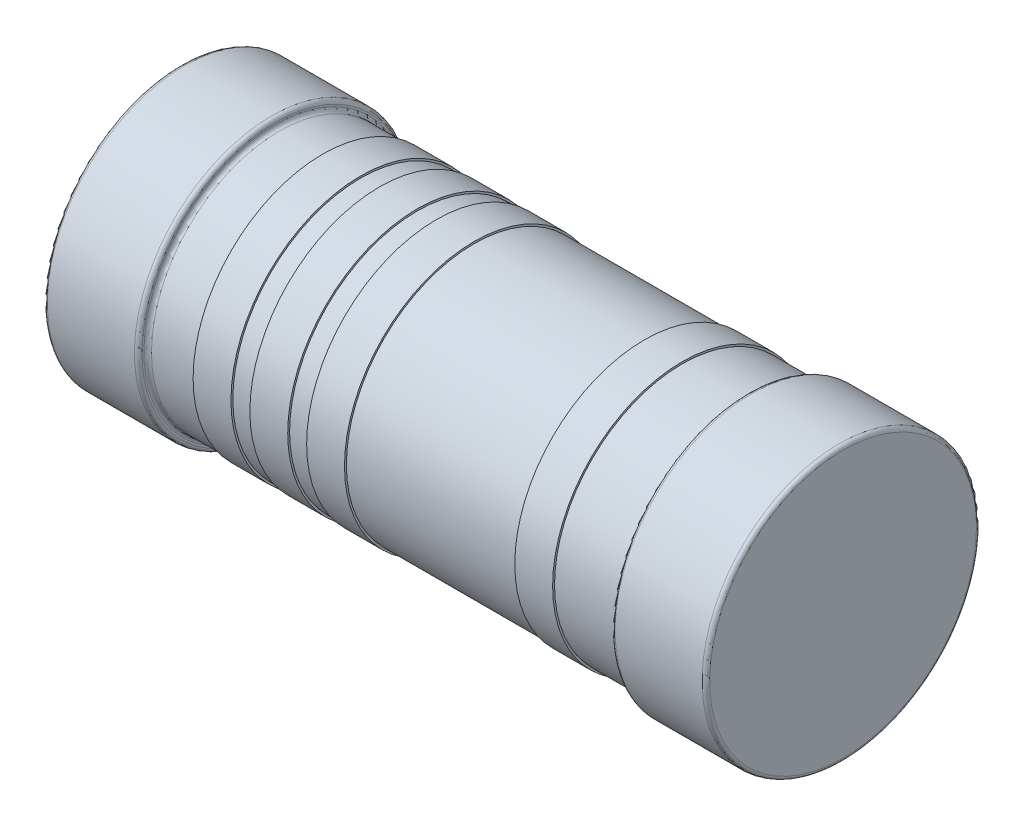
ISO-10303-21;
HEADER;
FILE_DESCRIPTION(('STEP AP214'),'2;1');
FILE_NAME('part.step','',(''),(''),'','','');
FILE_SCHEMA(('AUTOMOTIVE_DESIGN { 1 0 10303 214 1 1 1 1 }'));
ENDSEC;
DATA;
#1=APPLICATION_CONTEXT('core data for automotive mechanical design processes');
#2=APPLICATION_PROTOCOL_DEFINITION('international standard','automotive_design',2000,#1);
#3=PRODUCT_CONTEXT('',#1,'mechanical');
#4=PRODUCT('Part','Part','',(#3));
#5=PRODUCT_RELATED_PRODUCT_CATEGORY('part','',(#4));
#6=PRODUCT_DEFINITION_FORMATION('','',#4);
#7=PRODUCT_DEFINITION_CONTEXT('part definition',#1,'design');
#8=PRODUCT_DEFINITION('design','',#6,#7);
#9=PRODUCT_DEFINITION_SHAPE('','',#8);
#10=(LENGTH_UNIT() NAMED_UNIT(*) SI_UNIT(.MILLI.,.METRE.));
#11=(NAMED_UNIT(*) PLANE_ANGLE_UNIT() SI_UNIT($,.RADIAN.));
#12=(NAMED_UNIT(*) SI_UNIT($,.STERADIAN.) SOLID_ANGLE_UNIT());
#13=UNCERTAINTY_MEASURE_WITH_UNIT(LENGTH_MEASURE(1.E-05),#10,'distance_accuracy_value','');
#14=(GEOMETRIC_REPRESENTATION_CONTEXT(3) GLOBAL_UNCERTAINTY_ASSIGNED_CONTEXT((#13)) GLOBAL_UNIT_ASSIGNED_CONTEXT((#10,
#11,#12)) REPRESENTATION_CONTEXT('',''));
#15=CARTESIAN_POINT('',(0.,0.,0.));
#16=DIRECTION('',(0.,0.,1.));
#17=DIRECTION('',(1.,0.,0.));
#18=AXIS2_PLACEMENT_3D('',#15,#16,#17);
#19=CARTESIAN_POINT('',(-1.75,0.0200000000000001,0.));
#20=DIRECTION('',(1.,0.,0.));
#21=DIRECTION('',(0.,1.,0.));
#22=AXIS2_PLACEMENT_3D('',#19,#20,#21);
#23=PLANE('',#22);
#24=CARTESIAN_POINT('',(-1.75,0.725,0.));
#25=DIRECTION('',(1.,0.,0.));
#26=DIRECTION('',(0.,1.,0.));
#27=AXIS2_PLACEMENT_3D('',#24,#25,#26);
#28=CIRCLE('',#27,0.705);
#29=CARTESIAN_POINT('',(-1.75,1.43,0.));
#30=VERTEX_POINT('',#29);
#31=EDGE_CURVE('E121',#30,#30,#28,.T.);
#32=ORIENTED_EDGE('',*,*,#31,.F.);
#33=EDGE_LOOP('',(#32));
#34=FACE_BOUND('',#33,.T.);
#35=ADVANCED_FACE('F33',(#34),#23,.F.);
#36=CARTESIAN_POINT('',(1.75,0.725,0.));
#37=DIRECTION('',(-1.,0.,0.));
#38=DIRECTION('',(0.,-1.,0.));
#39=AXIS2_PLACEMENT_3D('',#36,#37,#38);
#40=PLANE('',#39);
#41=CARTESIAN_POINT('',(1.75,0.725,0.));
#42=DIRECTION('',(1.,0.,0.));
#43=DIRECTION('',(0.,1.,0.));
#44=AXIS2_PLACEMENT_3D('',#41,#42,#43);
#45=CIRCLE('',#44,0.705);
#46=CARTESIAN_POINT('',(1.75,1.43,0.));
#47=VERTEX_POINT('',#46);
#48=EDGE_CURVE('E10',#47,#47,#45,.T.);
#49=ORIENTED_EDGE('',*,*,#48,.T.);
#50=EDGE_LOOP('',(#49));
#51=FACE_BOUND('',#50,.T.);
#52=ADVANCED_FACE('F128',(#51),#40,.F.);
#53=CARTESIAN_POINT('',(1.73,0.725,0.));
#54=DIRECTION('',(1.,0.,0.));
#55=DIRECTION('',(0.,1.,0.));
#56=AXIS2_PLACEMENT_3D('',#53,#54,#55);
#57=TOROIDAL_SURFACE('',#56,0.705,0.0199999999999999);
#58=ORIENTED_EDGE('',*,*,#48,.F.);
#59=EDGE_LOOP('',(#58));
#60=FACE_BOUND('',#59,.T.);
#61=CARTESIAN_POINT('',(1.73,0.725,0.));
#62=DIRECTION('',(1.,0.,0.));
#63=DIRECTION('',(0.,1.,0.));
#64=AXIS2_PLACEMENT_3D('',#61,#62,#63);
#65=CIRCLE('',#64,0.725);
#66=CARTESIAN_POINT('',(1.73,1.45,0.));
#67=VERTEX_POINT('',#66);
#68=EDGE_CURVE('E39',#67,#67,#65,.T.);
#69=ORIENTED_EDGE('',*,*,#68,.T.);
#70=EDGE_LOOP('',(#69));
#71=FACE_BOUND('',#70,.T.);
#72=ADVANCED_FACE('F132',(#60,#71),#57,.T.);
#73=CARTESIAN_POINT('',(-1.75,0.725,0.));
#74=DIRECTION('',(1.,0.,0.));
#75=DIRECTION('',(0.,1.,0.));
#76=AXIS2_PLACEMENT_3D('',#73,#74,#75);
#77=CYLINDRICAL_SURFACE('',#76,0.725);
#78=ORIENTED_EDGE('',*,*,#68,.F.);
#79=EDGE_LOOP('',(#78));
#80=FACE_BOUND('',#79,.T.);
#81=CARTESIAN_POINT('',(1.27,0.725,0.));
#82=DIRECTION('',(1.,0.,0.));
#83=DIRECTION('',(0.,1.,0.));
#84=AXIS2_PLACEMENT_3D('',#81,#82,#83);
#85=CIRCLE('',#84,0.725);
#86=CARTESIAN_POINT('',(1.27,1.45,0.));
#87=VERTEX_POINT('',#86);
#88=EDGE_CURVE('E43',#87,#87,#85,.T.);
#89=ORIENTED_EDGE('',*,*,#88,.T.);
#90=EDGE_LOOP('',(#89));
#91=FACE_BOUND('',#90,.T.);
#92=ADVANCED_FACE('F136',(#80,#91),#77,.T.);
#93=CARTESIAN_POINT('',(1.27,0.725,0.));
#94=DIRECTION('',(1.,0.,0.));
#95=DIRECTION('',(0.,1.,0.));
#96=AXIS2_PLACEMENT_3D('',#93,#94,#95);
#97=TOROIDAL_SURFACE('',#96,0.705,0.0200000000000001);
#98=ORIENTED_EDGE('',*,*,#88,.F.);
#99=EDGE_LOOP('',(#98));
#100=FACE_BOUND('',#99,.T.);
#101=CARTESIAN_POINT('',(1.25,0.725,0.));
#102=DIRECTION('',(1.,0.,0.));
#103=DIRECTION('',(0.,1.,0.));
#104=AXIS2_PLACEMENT_3D('',#101,#102,#103);
#105=CIRCLE('',#104,0.705);
#106=CARTESIAN_POINT('',(1.25,1.43,0.));
#107=VERTEX_POINT('',#106);
#108=EDGE_CURVE('E47',#107,#107,#105,.T.);
#109=ORIENTED_EDGE('',*,*,#108,.T.);
#110=EDGE_LOOP('',(#109));
#111=FACE_BOUND('',#110,.T.);
#112=ADVANCED_FACE('F142',(#100,#111),#97,.T.);
#113=CARTESIAN_POINT('',(1.25,0.03,0.));
#114=DIRECTION('',(1.,0.,0.));
#115=DIRECTION('',(0.,1.,0.));
#116=AXIS2_PLACEMENT_3D('',#113,#114,#115);
#117=PLANE('',#116);
#118=ORIENTED_EDGE('',*,*,#108,.F.);
#119=EDGE_LOOP('',(#118));
#120=FACE_BOUND('',#119,.T.);
#121=CARTESIAN_POINT('',(1.25,0.725,0.));
#122=DIRECTION('',(1.,0.,0.));
#123=DIRECTION('',(0.,1.,0.));
#124=AXIS2_PLACEMENT_3D('',#121,#122,#123);
#125=CIRCLE('',#124,0.695);
#126=CARTESIAN_POINT('',(1.25,1.42,0.));
#127=VERTEX_POINT('',#126);
#128=EDGE_CURVE('E52',#127,#127,#125,.T.);
#129=ORIENTED_EDGE('',*,*,#128,.T.);
#130=EDGE_LOOP('',(#129));
#131=FACE_BOUND('',#130,.T.);
#132=ADVANCED_FACE('F146',(#120,#131),#117,.F.);
#133=CARTESIAN_POINT('',(1.23,0.725,0.));
#134=DIRECTION('',(1.,0.,0.));
#135=DIRECTION('',(0.,1.,0.));
#136=AXIS2_PLACEMENT_3D('',#133,#134,#135);
#137=TOROIDAL_SURFACE('',#136,0.695,0.0199999999999999);
#138=ORIENTED_EDGE('',*,*,#128,.F.);
#139=EDGE_LOOP('',(#138));
#140=FACE_BOUND('',#139,.T.);
#141=CARTESIAN_POINT('',(1.23,0.725,0.));
#142=DIRECTION('',(1.,0.,0.));
#143=DIRECTION('',(0.,1.,0.));
#144=AXIS2_PLACEMENT_3D('',#141,#142,#143);
#145=CIRCLE('',#144,0.675);
#146=CARTESIAN_POINT('',(1.23,1.4,0.));
#147=VERTEX_POINT('',#146);
#148=EDGE_CURVE('E55',#147,#147,#145,.T.);
#149=ORIENTED_EDGE('',*,*,#148,.T.);
#150=EDGE_LOOP('',(#149));
#151=FACE_BOUND('',#150,.T.);
#152=ADVANCED_FACE('F150',(#140,#151),#137,.F.);
#153=CARTESIAN_POINT('',(-1.75,0.725,0.));
#154=DIRECTION('',(1.,0.,0.));
#155=DIRECTION('',(0.,1.,0.));
#156=AXIS2_PLACEMENT_3D('',#153,#154,#155);
#157=CYLINDRICAL_SURFACE('',#156,0.675);
#158=ORIENTED_EDGE('',*,*,#148,.F.);
#159=EDGE_LOOP('',(#158));
#160=FACE_BOUND('',#159,.T.);
#161=CARTESIAN_POINT('',(0.9,0.725,0.));
#162=DIRECTION('',(1.,0.,0.));
#163=DIRECTION('',(0.,1.,0.));
#164=AXIS2_PLACEMENT_3D('',#161,#162,#163);
#165=CIRCLE('',#164,0.675);
#166=CARTESIAN_POINT('',(0.9,1.4,0.));
#167=VERTEX_POINT('',#166);
#168=EDGE_CURVE('E58',#167,#167,#165,.T.);
#169=ORIENTED_EDGE('',*,*,#168,.T.);
#170=EDGE_LOOP('',(#169));
#171=FACE_BOUND('',#170,.T.);
#172=ADVANCED_FACE('F154',(#160,#171),#157,.T.);
#173=CARTESIAN_POINT('',(0.9,0.05,0.));
#174=DIRECTION('',(-1.,0.,0.));
#175=DIRECTION('',(0.,-1.,0.));
#176=AXIS2_PLACEMENT_3D('',#173,#174,#175);
#177=PLANE('',#176);
#178=ORIENTED_EDGE('',*,*,#168,.F.);
#179=EDGE_LOOP('',(#178));
#180=FACE_BOUND('',#179,.T.);
#181=CARTESIAN_POINT('',(0.9,0.725,0.));
#182=DIRECTION('',(1.,0.,0.));
#183=DIRECTION('',(0.,1.,0.));
#184=AXIS2_PLACEMENT_3D('',#181,#182,#183);
#185=CIRCLE('',#184,0.685);
#186=CARTESIAN_POINT('',(0.9,1.41,0.));
#187=VERTEX_POINT('',#186);
#188=EDGE_CURVE('E61',#187,#187,#185,.T.);
#189=ORIENTED_EDGE('',*,*,#188,.T.);
#190=EDGE_LOOP('',(#189));
#191=FACE_BOUND('',#190,.T.);
#192=ADVANCED_FACE('F158',(#180,#191),#177,.F.);
#193=CARTESIAN_POINT('',(-1.75,0.725,0.));
#194=DIRECTION('',(1.,0.,0.));
#195=DIRECTION('',(0.,1.,0.));
#196=AXIS2_PLACEMENT_3D('',#193,#194,#195);
#197=CYLINDRICAL_SURFACE('',#196,0.685);
#198=ORIENTED_EDGE('',*,*,#188,.F.);
#199=EDGE_LOOP('',(#198));
#200=FACE_BOUND('',#199,.T.);
#201=CARTESIAN_POINT('',(0.7,0.725,0.));
#202=DIRECTION('',(1.,0.,0.));
#203=DIRECTION('',(0.,1.,0.));
#204=AXIS2_PLACEMENT_3D('',#201,#202,#203);
#205=CIRCLE('',#204,0.685);
#206=CARTESIAN_POINT('',(0.7,1.41,0.));
#207=VERTEX_POINT('',#206);
#208=EDGE_CURVE('E64',#207,#207,#205,.T.);
#209=ORIENTED_EDGE('',*,*,#208,.T.);
#210=EDGE_LOOP('',(#209));
#211=FACE_BOUND('',#210,.T.);
#212=ADVANCED_FACE('F162',(#200,#211),#197,.T.);
#213=CARTESIAN_POINT('',(0.7,0.0400000000000001,0.));
#214=DIRECTION('',(1.,0.,0.));
#215=DIRECTION('',(0.,1.,0.));
#216=AXIS2_PLACEMENT_3D('',#213,#214,#215);
#217=PLANE('',#216);
#218=ORIENTED_EDGE('',*,*,#208,.F.);
#219=EDGE_LOOP('',(#218));
#220=FACE_BOUND('',#219,.T.);
#221=CARTESIAN_POINT('',(0.7,0.725,0.));
#222=DIRECTION('',(1.,0.,0.));
#223=DIRECTION('',(0.,1.,0.));
#224=AXIS2_PLACEMENT_3D('',#221,#222,#223);
#225=CIRCLE('',#224,0.675);
#226=CARTESIAN_POINT('',(0.7,1.4,0.));
#227=VERTEX_POINT('',#226);
#228=EDGE_CURVE('E67',#227,#227,#225,.T.);
#229=ORIENTED_EDGE('',*,*,#228,.T.);
#230=EDGE_LOOP('',(#229));
#231=FACE_BOUND('',#230,.T.);
#232=ADVANCED_FACE('F166',(#220,#231),#217,.F.);
#233=CARTESIAN_POINT('',(-1.75,0.725,0.));
#234=DIRECTION('',(1.,0.,0.));
#235=DIRECTION('',(0.,1.,0.));
#236=AXIS2_PLACEMENT_3D('',#233,#234,#235);
#237=CYLINDRICAL_SURFACE('',#236,0.675);
#238=ORIENTED_EDGE('',*,*,#228,.F.);
#239=EDGE_LOOP('',(#238));
#240=FACE_BOUND('',#239,.T.);
#241=CARTESIAN_POINT('',(-0.2,0.725,0.));
#242=DIRECTION('',(1.,0.,0.));
#243=DIRECTION('',(0.,1.,0.));
#244=AXIS2_PLACEMENT_3D('',#241,#242,#243);
#245=CIRCLE('',#244,0.675);
#246=CARTESIAN_POINT('',(-0.2,1.4,0.));
#247=VERTEX_POINT('',#246);
#248=EDGE_CURVE('E70',#247,#247,#245,.T.);
#249=ORIENTED_EDGE('',*,*,#248,.T.);
#250=EDGE_LOOP('',(#249));
#251=FACE_BOUND('',#250,.T.);
#252=ADVANCED_FACE('F170',(#240,#251),#237,.T.);
#253=CARTESIAN_POINT('',(-0.2,0.04,0.));
#254=DIRECTION('',(-1.,0.,0.));
#255=DIRECTION('',(0.,-1.,0.));
#256=AXIS2_PLACEMENT_3D('',#253,#254,#255);
#257=PLANE('',#256);
#258=ORIENTED_EDGE('',*,*,#248,.F.);
#259=EDGE_LOOP('',(#258));
#260=FACE_BOUND('',#259,.T.);
#261=CARTESIAN_POINT('',(-0.2,0.725,0.));
#262=DIRECTION('',(1.,0.,0.));
#263=DIRECTION('',(0.,1.,0.));
#264=AXIS2_PLACEMENT_3D('',#261,#262,#263);
#265=CIRCLE('',#264,0.685);
#266=CARTESIAN_POINT('',(-0.2,1.41,0.));
#267=VERTEX_POINT('',#266);
#268=EDGE_CURVE('E73',#267,#267,#265,.T.);
#269=ORIENTED_EDGE('',*,*,#268,.T.);
#270=EDGE_LOOP('',(#269));
#271=FACE_BOUND('',#270,.T.);
#272=ADVANCED_FACE('F174',(#260,#271),#257,.F.);
#273=CARTESIAN_POINT('',(-1.75,0.725,0.));
#274=DIRECTION('',(1.,0.,0.));
#275=DIRECTION('',(0.,1.,0.));
#276=AXIS2_PLACEMENT_3D('',#273,#274,#275);
#277=CYLINDRICAL_SURFACE('',#276,0.685);
#278=ORIENTED_EDGE('',*,*,#268,.F.);
#279=EDGE_LOOP('',(#278));
#280=FACE_BOUND('',#279,.T.);
#281=CARTESIAN_POINT('',(-0.4,0.725,0.));
#282=DIRECTION('',(1.,0.,0.));
#283=DIRECTION('',(0.,1.,0.));
#284=AXIS2_PLACEMENT_3D('',#281,#282,#283);
#285=CIRCLE('',#284,0.685);
#286=CARTESIAN_POINT('',(-0.4,1.41,0.));
#287=VERTEX_POINT('',#286);
#288=EDGE_CURVE('E76',#287,#287,#285,.T.);
#289=ORIENTED_EDGE('',*,*,#288,.T.);
#290=EDGE_LOOP('',(#289));
#291=FACE_BOUND('',#290,.T.);
#292=ADVANCED_FACE('F178',(#280,#291),#277,.T.);
#293=CARTESIAN_POINT('',(-0.4,0.04,0.));
#294=DIRECTION('',(1.,0.,0.));
#295=DIRECTION('',(0.,1.,0.));
#296=AXIS2_PLACEMENT_3D('',#293,#294,#295);
#297=PLANE('',#296);
#298=ORIENTED_EDGE('',*,*,#288,.F.);
#299=EDGE_LOOP('',(#298));
#300=FACE_BOUND('',#299,.T.);
#301=CARTESIAN_POINT('',(-0.4,0.725,0.));
#302=DIRECTION('',(1.,0.,0.));
#303=DIRECTION('',(0.,1.,0.));
#304=AXIS2_PLACEMENT_3D('',#301,#302,#303);
#305=CIRCLE('',#304,0.675);
#306=CARTESIAN_POINT('',(-0.4,1.4,0.));
#307=VERTEX_POINT('',#306);
#308=EDGE_CURVE('E79',#307,#307,#305,.T.);
#309=ORIENTED_EDGE('',*,*,#308,.T.);
#310=EDGE_LOOP('',(#309));
#311=FACE_BOUND('',#310,.T.);
#312=ADVANCED_FACE('F182',(#300,#311),#297,.F.);
#313=CARTESIAN_POINT('',(-1.75,0.725,0.));
#314=DIRECTION('',(1.,0.,0.));
#315=DIRECTION('',(0.,1.,0.));
#316=AXIS2_PLACEMENT_3D('',#313,#314,#315);
#317=CYLINDRICAL_SURFACE('',#316,0.675);
#318=ORIENTED_EDGE('',*,*,#308,.F.);
#319=EDGE_LOOP('',(#318));
#320=FACE_BOUND('',#319,.T.);
#321=CARTESIAN_POINT('',(-0.5,0.725,0.));
#322=DIRECTION('',(1.,0.,0.));
#323=DIRECTION('',(0.,1.,0.));
#324=AXIS2_PLACEMENT_3D('',#321,#322,#323);
#325=CIRCLE('',#324,0.675);
#326=CARTESIAN_POINT('',(-0.5,1.4,0.));
#327=VERTEX_POINT('',#326);
#328=EDGE_CURVE('E82',#327,#327,#325,.T.);
#329=ORIENTED_EDGE('',*,*,#328,.T.);
#330=EDGE_LOOP('',(#329));
#331=FACE_BOUND('',#330,.T.);
#332=ADVANCED_FACE('F186',(#320,#331),#317,.T.);
#333=CARTESIAN_POINT('',(-0.5,0.04,0.));
#334=DIRECTION('',(-1.,0.,0.));
#335=DIRECTION('',(0.,-1.,0.));
#336=AXIS2_PLACEMENT_3D('',#333,#334,#335);
#337=PLANE('',#336);
#338=ORIENTED_EDGE('',*,*,#328,.F.);
#339=EDGE_LOOP('',(#338));
#340=FACE_BOUND('',#339,.T.);
#341=CARTESIAN_POINT('',(-0.5,0.725,0.));
#342=DIRECTION('',(1.,0.,0.));
#343=DIRECTION('',(0.,1.,0.));
#344=AXIS2_PLACEMENT_3D('',#341,#342,#343);
#345=CIRCLE('',#344,0.685);
#346=CARTESIAN_POINT('',(-0.5,1.41,0.));
#347=VERTEX_POINT('',#346);
#348=EDGE_CURVE('E85',#347,#347,#345,.T.);
#349=ORIENTED_EDGE('',*,*,#348,.T.);
#350=EDGE_LOOP('',(#349));
#351=FACE_BOUND('',#350,.T.);
#352=ADVANCED_FACE('F190',(#340,#351),#337,.F.);
#353=CARTESIAN_POINT('',(-1.75,0.725,0.));
#354=DIRECTION('',(1.,0.,0.));
#355=DIRECTION('',(0.,1.,0.));
#356=AXIS2_PLACEMENT_3D('',#353,#354,#355);
#357=CYLINDRICAL_SURFACE('',#356,0.685);
#358=ORIENTED_EDGE('',*,*,#348,.F.);
#359=EDGE_LOOP('',(#358));
#360=FACE_BOUND('',#359,.T.);
#361=CARTESIAN_POINT('',(-0.7,0.725,0.));
#362=DIRECTION('',(1.,0.,0.));
#363=DIRECTION('',(0.,1.,0.));
#364=AXIS2_PLACEMENT_3D('',#361,#362,#363);
#365=CIRCLE('',#364,0.685);
#366=CARTESIAN_POINT('',(-0.7,1.41,0.));
#367=VERTEX_POINT('',#366);
#368=EDGE_CURVE('E88',#367,#367,#365,.T.);
#369=ORIENTED_EDGE('',*,*,#368,.T.);
#370=EDGE_LOOP('',(#369));
#371=FACE_BOUND('',#370,.T.);
#372=ADVANCED_FACE('F194',(#360,#371),#357,.T.);
#373=CARTESIAN_POINT('',(-0.7,0.05,0.));
#374=DIRECTION('',(1.,0.,0.));
#375=DIRECTION('',(0.,1.,0.));
#376=AXIS2_PLACEMENT_3D('',#373,#374,#375);
#377=PLANE('',#376);
#378=ORIENTED_EDGE('',*,*,#368,.F.);
#379=EDGE_LOOP('',(#378));
#380=FACE_BOUND('',#379,.T.);
#381=CARTESIAN_POINT('',(-0.7,0.725,0.));
#382=DIRECTION('',(1.,0.,0.));
#383=DIRECTION('',(0.,1.,0.));
#384=AXIS2_PLACEMENT_3D('',#381,#382,#383);
#385=CIRCLE('',#384,0.675);
#386=CARTESIAN_POINT('',(-0.7,1.4,0.));
#387=VERTEX_POINT('',#386);
#388=EDGE_CURVE('E91',#387,#387,#385,.T.);
#389=ORIENTED_EDGE('',*,*,#388,.T.);
#390=EDGE_LOOP('',(#389));
#391=FACE_BOUND('',#390,.T.);
#392=ADVANCED_FACE('F198',(#380,#391),#377,.F.);
#393=CARTESIAN_POINT('',(-1.75,0.725,0.));
#394=DIRECTION('',(1.,0.,0.));
#395=DIRECTION('',(0.,1.,0.));
#396=AXIS2_PLACEMENT_3D('',#393,#394,#395);
#397=CYLINDRICAL_SURFACE('',#396,0.675);
#398=ORIENTED_EDGE('',*,*,#388,.F.);
#399=EDGE_LOOP('',(#398));
#400=FACE_BOUND('',#399,.T.);
#401=CARTESIAN_POINT('',(-0.8,0.725,0.));
#402=DIRECTION('',(1.,0.,0.));
#403=DIRECTION('',(0.,1.,0.));
#404=AXIS2_PLACEMENT_3D('',#401,#402,#403);
#405=CIRCLE('',#404,0.675);
#406=CARTESIAN_POINT('',(-0.8,1.4,0.));
#407=VERTEX_POINT('',#406);
#408=EDGE_CURVE('E94',#407,#407,#405,.T.);
#409=ORIENTED_EDGE('',*,*,#408,.T.);
#410=EDGE_LOOP('',(#409));
#411=FACE_BOUND('',#410,.T.);
#412=ADVANCED_FACE('F202',(#400,#411),#397,.T.);
#413=CARTESIAN_POINT('',(-0.8,0.04,0.));
#414=DIRECTION('',(-1.,0.,0.));
#415=DIRECTION('',(0.,-1.,0.));
#416=AXIS2_PLACEMENT_3D('',#413,#414,#415);
#417=PLANE('',#416);
#418=ORIENTED_EDGE('',*,*,#408,.F.);
#419=EDGE_LOOP('',(#418));
#420=FACE_BOUND('',#419,.T.);
#421=CARTESIAN_POINT('',(-0.8,0.725,0.));
#422=DIRECTION('',(1.,0.,0.));
#423=DIRECTION('',(0.,1.,0.));
#424=AXIS2_PLACEMENT_3D('',#421,#422,#423);
#425=CIRCLE('',#424,0.685);
#426=CARTESIAN_POINT('',(-0.8,1.41,0.));
#427=VERTEX_POINT('',#426);
#428=EDGE_CURVE('E97',#427,#427,#425,.T.);
#429=ORIENTED_EDGE('',*,*,#428,.T.);
#430=EDGE_LOOP('',(#429));
#431=FACE_BOUND('',#430,.T.);
#432=ADVANCED_FACE('F206',(#420,#431),#417,.F.);
#433=CARTESIAN_POINT('',(-1.75,0.725,0.));
#434=DIRECTION('',(1.,0.,0.));
#435=DIRECTION('',(0.,1.,0.));
#436=AXIS2_PLACEMENT_3D('',#433,#434,#435);
#437=CYLINDRICAL_SURFACE('',#436,0.685);
#438=ORIENTED_EDGE('',*,*,#428,.F.);
#439=EDGE_LOOP('',(#438));
#440=FACE_BOUND('',#439,.T.);
#441=CARTESIAN_POINT('',(-1.,0.725,0.));
#442=DIRECTION('',(1.,0.,0.));
#443=DIRECTION('',(0.,1.,0.));
#444=AXIS2_PLACEMENT_3D('',#441,#442,#443);
#445=CIRCLE('',#444,0.685);
#446=CARTESIAN_POINT('',(-1.,1.41,0.));
#447=VERTEX_POINT('',#446);
#448=EDGE_CURVE('E100',#447,#447,#445,.T.);
#449=ORIENTED_EDGE('',*,*,#448,.T.);
#450=EDGE_LOOP('',(#449));
#451=FACE_BOUND('',#450,.T.);
#452=ADVANCED_FACE('F210',(#440,#451),#437,.T.);
#453=CARTESIAN_POINT('',(-1.,0.05,0.));
#454=DIRECTION('',(1.,0.,0.));
#455=DIRECTION('',(0.,1.,0.));
#456=AXIS2_PLACEMENT_3D('',#453,#454,#455);
#457=PLANE('',#456);
#458=ORIENTED_EDGE('',*,*,#448,.F.);
#459=EDGE_LOOP('',(#458));
#460=FACE_BOUND('',#459,.T.);
#461=CARTESIAN_POINT('',(-1.,0.725,0.));
#462=DIRECTION('',(1.,0.,0.));
#463=DIRECTION('',(0.,1.,0.));
#464=AXIS2_PLACEMENT_3D('',#461,#462,#463);
#465=CIRCLE('',#464,0.675);
#466=CARTESIAN_POINT('',(-1.,1.4,0.));
#467=VERTEX_POINT('',#466);
#468=EDGE_CURVE('E103',#467,#467,#465,.T.);
#469=ORIENTED_EDGE('',*,*,#468,.T.);
#470=EDGE_LOOP('',(#469));
#471=FACE_BOUND('',#470,.T.);
#472=ADVANCED_FACE('F214',(#460,#471),#457,.F.);
#473=CARTESIAN_POINT('',(-1.75,0.725,0.));
#474=DIRECTION('',(1.,0.,0.));
#475=DIRECTION('',(0.,1.,0.));
#476=AXIS2_PLACEMENT_3D('',#473,#474,#475);
#477=CYLINDRICAL_SURFACE('',#476,0.675);
#478=ORIENTED_EDGE('',*,*,#468,.F.);
#479=EDGE_LOOP('',(#478));
#480=FACE_BOUND('',#479,.T.);
#481=CARTESIAN_POINT('',(-1.23,0.725,0.));
#482=DIRECTION('',(1.,0.,0.));
#483=DIRECTION('',(0.,1.,0.));
#484=AXIS2_PLACEMENT_3D('',#481,#482,#483);
#485=CIRCLE('',#484,0.675);
#486=CARTESIAN_POINT('',(-1.23,1.4,0.));
#487=VERTEX_POINT('',#486);
#488=EDGE_CURVE('E106',#487,#487,#485,.T.);
#489=ORIENTED_EDGE('',*,*,#488,.T.);
#490=EDGE_LOOP('',(#489));
#491=FACE_BOUND('',#490,.T.);
#492=ADVANCED_FACE('F218',(#480,#491),#477,.T.);
#493=CARTESIAN_POINT('',(-1.23,0.725,0.));
#494=DIRECTION('',(1.,0.,0.));
#495=DIRECTION('',(0.,1.,0.));
#496=AXIS2_PLACEMENT_3D('',#493,#494,#495);
#497=TOROIDAL_SURFACE('',#496,0.695,0.0199999999999999);
#498=ORIENTED_EDGE('',*,*,#488,.F.);
#499=EDGE_LOOP('',(#498));
#500=FACE_BOUND('',#499,.T.);
#501=CARTESIAN_POINT('',(-1.25,0.725,0.));
#502=DIRECTION('',(1.,0.,0.));
#503=DIRECTION('',(0.,1.,0.));
#504=AXIS2_PLACEMENT_3D('',#501,#502,#503);
#505=CIRCLE('',#504,0.695);
#506=CARTESIAN_POINT('',(-1.25,1.42,0.));
#507=VERTEX_POINT('',#506);
#508=EDGE_CURVE('E109',#507,#507,#505,.T.);
#509=ORIENTED_EDGE('',*,*,#508,.T.);
#510=EDGE_LOOP('',(#509));
#511=FACE_BOUND('',#510,.T.);
#512=ADVANCED_FACE('F222',(#500,#511),#497,.F.);
#513=CARTESIAN_POINT('',(-1.25,0.02,0.));
#514=DIRECTION('',(-1.,0.,0.));
#515=DIRECTION('',(0.,-1.,0.));
#516=AXIS2_PLACEMENT_3D('',#513,#514,#515);
#517=PLANE('',#516);
#518=ORIENTED_EDGE('',*,*,#508,.F.);
#519=EDGE_LOOP('',(#518));
#520=FACE_BOUND('',#519,.T.);
#521=CARTESIAN_POINT('',(-1.25,0.725,0.));
#522=DIRECTION('',(1.,0.,0.));
#523=DIRECTION('',(0.,1.,0.));
#524=AXIS2_PLACEMENT_3D('',#521,#522,#523);
#525=CIRCLE('',#524,0.705);
#526=CARTESIAN_POINT('',(-1.25,1.43,0.));
#527=VERTEX_POINT('',#526);
#528=EDGE_CURVE('E112',#527,#527,#525,.T.);
#529=ORIENTED_EDGE('',*,*,#528,.T.);
#530=EDGE_LOOP('',(#529));
#531=FACE_BOUND('',#530,.T.);
#532=ADVANCED_FACE('F226',(#520,#531),#517,.F.);
#533=CARTESIAN_POINT('',(-1.27,0.725,0.));
#534=DIRECTION('',(1.,0.,0.));
#535=DIRECTION('',(0.,1.,0.));
#536=AXIS2_PLACEMENT_3D('',#533,#534,#535);
#537=TOROIDAL_SURFACE('',#536,0.705,0.0200000000000001);
#538=ORIENTED_EDGE('',*,*,#528,.F.);
#539=EDGE_LOOP('',(#538));
#540=FACE_BOUND('',#539,.T.);
#541=CARTESIAN_POINT('',(-1.27,0.725,0.));
#542=DIRECTION('',(1.,0.,0.));
#543=DIRECTION('',(0.,1.,0.));
#544=AXIS2_PLACEMENT_3D('',#541,#542,#543);
#545=CIRCLE('',#544,0.725);
#546=CARTESIAN_POINT('',(-1.27,1.45,0.));
#547=VERTEX_POINT('',#546);
#548=EDGE_CURVE('E115',#547,#547,#545,.T.);
#549=ORIENTED_EDGE('',*,*,#548,.T.);
#550=EDGE_LOOP('',(#549));
#551=FACE_BOUND('',#550,.T.);
#552=ADVANCED_FACE('F230',(#540,#551),#537,.T.);
#553=CARTESIAN_POINT('',(-1.75,0.725,0.));
#554=DIRECTION('',(1.,0.,0.));
#555=DIRECTION('',(0.,1.,0.));
#556=AXIS2_PLACEMENT_3D('',#553,#554,#555);
#557=CYLINDRICAL_SURFACE('',#556,0.725);
#558=ORIENTED_EDGE('',*,*,#548,.F.);
#559=EDGE_LOOP('',(#558));
#560=FACE_BOUND('',#559,.T.);
#561=CARTESIAN_POINT('',(-1.73,0.725,0.));
#562=DIRECTION('',(1.,0.,0.));
#563=DIRECTION('',(0.,1.,0.));
#564=AXIS2_PLACEMENT_3D('',#561,#562,#563);
#565=CIRCLE('',#564,0.725);
#566=CARTESIAN_POINT('',(-1.73,1.45,0.));
#567=VERTEX_POINT('',#566);
#568=EDGE_CURVE('E118',#567,#567,#565,.T.);
#569=ORIENTED_EDGE('',*,*,#568,.T.);
#570=EDGE_LOOP('',(#569));
#571=FACE_BOUND('',#570,.T.);
#572=ADVANCED_FACE('F234',(#560,#571),#557,.T.);
#573=CARTESIAN_POINT('',(-1.73,0.725,0.));
#574=DIRECTION('',(1.,0.,0.));
#575=DIRECTION('',(0.,1.,0.));
#576=AXIS2_PLACEMENT_3D('',#573,#574,#575);
#577=TOROIDAL_SURFACE('',#576,0.705,0.0199999999999999);
#578=ORIENTED_EDGE('',*,*,#568,.F.);
#579=EDGE_LOOP('',(#578));
#580=FACE_BOUND('',#579,.T.);
#581=ORIENTED_EDGE('',*,*,#31,.T.);
#582=EDGE_LOOP('',(#581));
#583=FACE_BOUND('',#582,.T.);
#584=ADVANCED_FACE('F125',(#580,#583),#577,.T.);
#585=CLOSED_SHELL('',(#35,#52,#72,#92,#112,#132,#152,#172,#192,#212,#232,#252,#272,#292,#312,
#332,#352,#372,#392,#412,#432,#452,#472,#492,#512,#532,#552,#572,#584));
#586=MANIFOLD_SOLID_BREP('B2',#585);
#587=ADVANCED_BREP_SHAPE_REPRESENTATION('',(#18,#586),#14);
#588=SHAPE_DEFINITION_REPRESENTATION(#9,#587);
ENDSEC;
END-ISO-10303-21;
